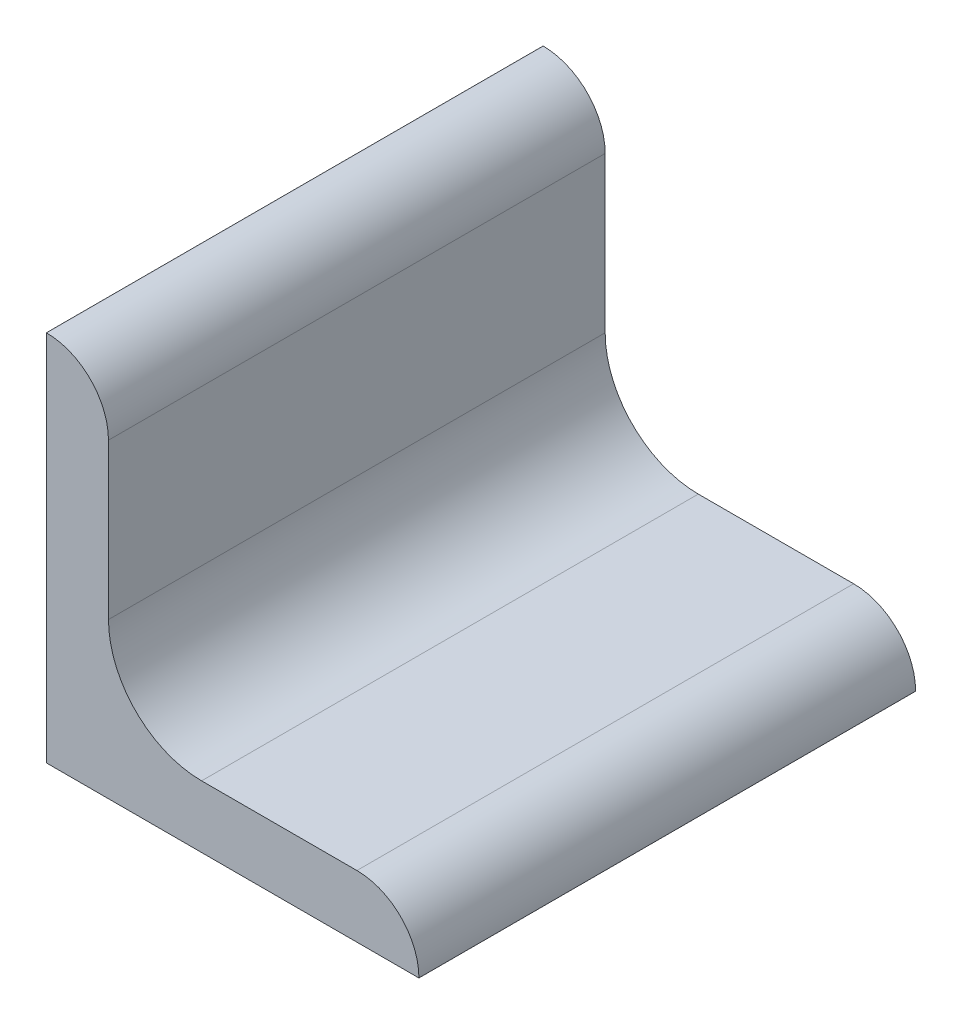
ISO-10303-21;
HEADER;
FILE_DESCRIPTION(('STEP AP214'),'2;1');
FILE_NAME('part.step','',(''),(''),'','','');
FILE_SCHEMA(('AUTOMOTIVE_DESIGN { 1 0 10303 214 1 1 1 1 }'));
ENDSEC;
DATA;
#1=APPLICATION_CONTEXT('core data for automotive mechanical design processes');
#2=APPLICATION_PROTOCOL_DEFINITION('international standard','automotive_design',2000,#1);
#3=PRODUCT_CONTEXT('',#1,'mechanical');
#4=PRODUCT('Part','Part','',(#3));
#5=PRODUCT_RELATED_PRODUCT_CATEGORY('part','',(#4));
#6=PRODUCT_DEFINITION_FORMATION('','',#4);
#7=PRODUCT_DEFINITION_CONTEXT('part definition',#1,'design');
#8=PRODUCT_DEFINITION('design','',#6,#7);
#9=PRODUCT_DEFINITION_SHAPE('','',#8);
#10=(LENGTH_UNIT() NAMED_UNIT(*) SI_UNIT(.MILLI.,.METRE.));
#11=(NAMED_UNIT(*) PLANE_ANGLE_UNIT() SI_UNIT($,.RADIAN.));
#12=(NAMED_UNIT(*) SI_UNIT($,.STERADIAN.) SOLID_ANGLE_UNIT());
#13=UNCERTAINTY_MEASURE_WITH_UNIT(LENGTH_MEASURE(1.E-05),#10,'distance_accuracy_value','');
#14=(GEOMETRIC_REPRESENTATION_CONTEXT(3) GLOBAL_UNCERTAINTY_ASSIGNED_CONTEXT((#13)) GLOBAL_UNIT_ASSIGNED_CONTEXT((#10,
#11,#12)) REPRESENTATION_CONTEXT('',''));
#15=CARTESIAN_POINT('',(0.,0.,0.));
#16=DIRECTION('',(0.,0.,1.));
#17=DIRECTION('',(1.,0.,0.));
#18=AXIS2_PLACEMENT_3D('',#15,#16,#17);
#19=CARTESIAN_POINT('',(19.05,0.,12.7));
#20=DIRECTION('',(0.,1.,0.));
#21=DIRECTION('',(-1.,0.,0.));
#22=AXIS2_PLACEMENT_3D('',#19,#20,#21);
#23=PLANE('',#22);
#24=DIRECTION('',(1.,0.,0.));
#25=VECTOR('',#24,1.);
#26=CARTESIAN_POINT('',(19.05,0.,-12.7));
#27=LINE('',#26,#25);
#28=CARTESIAN_POINT('',(0.,0.,-12.7));
#29=VERTEX_POINT('',#28);
#30=CARTESIAN_POINT('',(19.05,0.,-12.7));
#31=VERTEX_POINT('',#30);
#32=EDGE_CURVE('E135',#29,#31,#27,.T.);
#33=ORIENTED_EDGE('',*,*,#32,.T.);
#34=DIRECTION('',(0.,0.,-1.));
#35=VECTOR('',#34,1.);
#36=CARTESIAN_POINT('',(19.05,0.,12.7));
#37=LINE('',#36,#35);
#38=CARTESIAN_POINT('',(19.05,0.,12.7));
#39=VERTEX_POINT('',#38);
#40=EDGE_CURVE('E11',#39,#31,#37,.T.);
#41=ORIENTED_EDGE('',*,*,#40,.F.);
#42=DIRECTION('',(1.,0.,0.));
#43=VECTOR('',#42,1.);
#44=CARTESIAN_POINT('',(19.05,0.,12.7));
#45=LINE('',#44,#43);
#46=CARTESIAN_POINT('',(0.,0.,12.7));
#47=VERTEX_POINT('',#46);
#48=EDGE_CURVE('E151',#47,#39,#45,.T.);
#49=ORIENTED_EDGE('',*,*,#48,.F.);
#50=DIRECTION('',(0.,0.,-1.));
#51=VECTOR('',#50,1.);
#52=CARTESIAN_POINT('',(0.,0.,12.7));
#53=LINE('',#52,#51);
#54=EDGE_CURVE('E131',#47,#29,#53,.T.);
#55=ORIENTED_EDGE('',*,*,#54,.T.);
#56=EDGE_LOOP('',(#33,#41,#49,#55));
#57=FACE_BOUND('',#56,.T.);
#58=ADVANCED_FACE('F33',(#57),#23,.F.);
#59=CARTESIAN_POINT('',(19.05,0.00507999999999611,12.7));
#60=DIRECTION('',(-1.,0.,0.));
#61=DIRECTION('',(0.,0.,1.));
#62=AXIS2_PLACEMENT_3D('',#59,#60,#61);
#63=PLANE('',#62);
#64=DIRECTION('',(0.,1.,0.));
#65=VECTOR('',#64,1.);
#66=CARTESIAN_POINT('',(19.05,0.00507999999999611,-12.7));
#67=LINE('',#66,#65);
#68=CARTESIAN_POINT('',(19.05,0.00507999999999611,-12.7));
#69=VERTEX_POINT('',#68);
#70=EDGE_CURVE('E138',#31,#69,#67,.T.);
#71=ORIENTED_EDGE('',*,*,#70,.T.);
#72=DIRECTION('',(0.,0.,-1.));
#73=VECTOR('',#72,1.);
#74=CARTESIAN_POINT('',(19.05,0.00507999999999611,12.7));
#75=LINE('',#74,#73);
#76=CARTESIAN_POINT('',(19.05,0.00507999999999611,12.7));
#77=VERTEX_POINT('',#76);
#78=EDGE_CURVE('E41',#77,#69,#75,.T.);
#79=ORIENTED_EDGE('',*,*,#78,.F.);
#80=DIRECTION('',(0.,1.,0.));
#81=VECTOR('',#80,1.);
#82=CARTESIAN_POINT('',(19.05,0.00507999999999611,12.7));
#83=LINE('',#82,#81);
#84=EDGE_CURVE('E95',#39,#77,#83,.T.);
#85=ORIENTED_EDGE('',*,*,#84,.F.);
#86=ORIENTED_EDGE('',*,*,#40,.T.);
#87=EDGE_LOOP('',(#71,#79,#85,#86));
#88=FACE_BOUND('',#87,.T.);
#89=ADVANCED_FACE('F194',(#88),#63,.F.);
#90=CARTESIAN_POINT('',(15.88008,0.00507999999999573,12.7));
#91=DIRECTION('',(0.,0.,-1.));
#92=DIRECTION('',(-1.,0.,0.));
#93=AXIS2_PLACEMENT_3D('',#90,#91,#92);
#94=CYLINDRICAL_SURFACE('',#93,3.16992);
#95=CARTESIAN_POINT('',(15.88008,0.00507999999999573,-12.7));
#96=DIRECTION('',(0.,0.,1.));
#97=DIRECTION('',(1.,0.,0.));
#98=AXIS2_PLACEMENT_3D('',#95,#96,#97);
#99=CIRCLE('',#98,3.16992);
#100=CARTESIAN_POINT('',(15.88008,3.17499999999999,-12.7));
#101=VERTEX_POINT('',#100);
#102=EDGE_CURVE('E140',#69,#101,#99,.T.);
#103=ORIENTED_EDGE('',*,*,#102,.T.);
#104=DIRECTION('',(0.,0.,-1.));
#105=VECTOR('',#104,1.);
#106=CARTESIAN_POINT('',(15.88008,3.17499999999999,12.7));
#107=LINE('',#106,#105);
#108=CARTESIAN_POINT('',(15.88008,3.17499999999999,12.7));
#109=VERTEX_POINT('',#108);
#110=EDGE_CURVE('E161',#109,#101,#107,.T.);
#111=ORIENTED_EDGE('',*,*,#110,.F.);
#112=CARTESIAN_POINT('',(15.88008,0.00507999999999573,12.7));
#113=DIRECTION('',(0.,0.,1.));
#114=DIRECTION('',(1.,0.,0.));
#115=AXIS2_PLACEMENT_3D('',#112,#113,#114);
#116=CIRCLE('',#115,3.16992);
#117=EDGE_CURVE('E169',#77,#109,#116,.T.);
#118=ORIENTED_EDGE('',*,*,#117,.F.);
#119=ORIENTED_EDGE('',*,*,#78,.T.);
#120=EDGE_LOOP('',(#103,#111,#118,#119));
#121=FACE_BOUND('',#120,.T.);
#122=ADVANCED_FACE('F167',(#121),#94,.T.);
#123=CARTESIAN_POINT('',(7.93749999999999,3.175,12.7));
#124=DIRECTION('',(0.,-1.,0.));
#125=DIRECTION('',(1.,0.,0.));
#126=AXIS2_PLACEMENT_3D('',#123,#124,#125);
#127=PLANE('',#126);
#128=DIRECTION('',(-1.,0.,0.));
#129=VECTOR('',#128,1.);
#130=CARTESIAN_POINT('',(7.93749999999999,3.175,-12.7));
#131=LINE('',#130,#129);
#132=CARTESIAN_POINT('',(7.93749999999999,3.17499999999999,-12.7));
#133=VERTEX_POINT('',#132);
#134=EDGE_CURVE('E142',#101,#133,#131,.T.);
#135=ORIENTED_EDGE('',*,*,#134,.T.);
#136=DIRECTION('',(0.,0.,-1.));
#137=VECTOR('',#136,1.);
#138=CARTESIAN_POINT('',(7.93749999999999,3.17499999999999,12.7));
#139=LINE('',#138,#137);
#140=CARTESIAN_POINT('',(7.93749999999999,3.17499999999999,12.7));
#141=VERTEX_POINT('',#140);
#142=EDGE_CURVE('E158',#141,#133,#139,.T.);
#143=ORIENTED_EDGE('',*,*,#142,.F.);
#144=DIRECTION('',(-1.,0.,0.));
#145=VECTOR('',#144,1.);
#146=CARTESIAN_POINT('',(7.93749999999999,3.175,12.7));
#147=LINE('',#146,#145);
#148=EDGE_CURVE('E185',#109,#141,#147,.T.);
#149=ORIENTED_EDGE('',*,*,#148,.F.);
#150=ORIENTED_EDGE('',*,*,#110,.T.);
#151=EDGE_LOOP('',(#135,#143,#149,#150));
#152=FACE_BOUND('',#151,.T.);
#153=ADVANCED_FACE('F178',(#152),#127,.F.);
#154=CARTESIAN_POINT('',(7.93749999999999,7.93749999999999,12.7));
#155=DIRECTION('',(0.,0.,-1.));
#156=DIRECTION('',(-1.,0.,0.));
#157=AXIS2_PLACEMENT_3D('',#154,#155,#156);
#158=CYLINDRICAL_SURFACE('',#157,4.7625);
#159=CARTESIAN_POINT('',(7.93749999999999,7.93749999999999,-12.7));
#160=DIRECTION('',(0.,0.,-1.));
#161=DIRECTION('',(-1.,0.,0.));
#162=AXIS2_PLACEMENT_3D('',#159,#160,#161);
#163=CIRCLE('',#162,4.7625);
#164=CARTESIAN_POINT('',(3.17499999999999,7.93749999999999,-12.7));
#165=VERTEX_POINT('',#164);
#166=EDGE_CURVE('E144',#133,#165,#163,.T.);
#167=ORIENTED_EDGE('',*,*,#166,.T.);
#168=DIRECTION('',(0.,0.,-1.));
#169=VECTOR('',#168,1.);
#170=CARTESIAN_POINT('',(3.17499999999999,7.93749999999999,12.7));
#171=LINE('',#170,#169);
#172=CARTESIAN_POINT('',(3.17499999999999,7.93749999999999,12.7));
#173=VERTEX_POINT('',#172);
#174=EDGE_CURVE('E155',#173,#165,#171,.T.);
#175=ORIENTED_EDGE('',*,*,#174,.F.);
#176=CARTESIAN_POINT('',(7.93749999999999,7.93749999999999,12.7));
#177=DIRECTION('',(0.,0.,-1.));
#178=DIRECTION('',(-1.,0.,0.));
#179=AXIS2_PLACEMENT_3D('',#176,#177,#178);
#180=CIRCLE('',#179,4.7625);
#181=EDGE_CURVE('E184',#141,#173,#180,.T.);
#182=ORIENTED_EDGE('',*,*,#181,.F.);
#183=ORIENTED_EDGE('',*,*,#142,.T.);
#184=EDGE_LOOP('',(#167,#175,#182,#183));
#185=FACE_BOUND('',#184,.T.);
#186=ADVANCED_FACE('F182',(#185),#158,.F.);
#187=CARTESIAN_POINT('',(3.175,15.88008,12.7));
#188=DIRECTION('',(-1.,0.,0.));
#189=DIRECTION('',(0.,-1.,0.));
#190=AXIS2_PLACEMENT_3D('',#187,#188,#189);
#191=PLANE('',#190);
#192=DIRECTION('',(0.,1.,0.));
#193=VECTOR('',#192,1.);
#194=CARTESIAN_POINT('',(3.175,15.88008,-12.7));
#195=LINE('',#194,#193);
#196=CARTESIAN_POINT('',(3.175,15.88008,-12.7));
#197=VERTEX_POINT('',#196);
#198=EDGE_CURVE('E146',#165,#197,#195,.T.);
#199=ORIENTED_EDGE('',*,*,#198,.T.);
#200=DIRECTION('',(0.,0.,-1.));
#201=VECTOR('',#200,1.);
#202=CARTESIAN_POINT('',(3.175,15.88008,12.7));
#203=LINE('',#202,#201);
#204=CARTESIAN_POINT('',(3.175,15.88008,12.7));
#205=VERTEX_POINT('',#204);
#206=EDGE_CURVE('E126',#205,#197,#203,.T.);
#207=ORIENTED_EDGE('',*,*,#206,.F.);
#208=DIRECTION('',(0.,1.,0.));
#209=VECTOR('',#208,1.);
#210=CARTESIAN_POINT('',(3.175,15.88008,12.7));
#211=LINE('',#210,#209);
#212=EDGE_CURVE('E117',#173,#205,#211,.T.);
#213=ORIENTED_EDGE('',*,*,#212,.F.);
#214=ORIENTED_EDGE('',*,*,#174,.T.);
#215=EDGE_LOOP('',(#199,#207,#213,#214));
#216=FACE_BOUND('',#215,.T.);
#217=ADVANCED_FACE('F206',(#216),#191,.F.);
#218=CARTESIAN_POINT('',(0.00508000000000019,15.88008,12.7));
#219=DIRECTION('',(0.,0.,-1.));
#220=DIRECTION('',(-1.,0.,0.));
#221=AXIS2_PLACEMENT_3D('',#218,#219,#220);
#222=CYLINDRICAL_SURFACE('',#221,3.16992);
#223=CARTESIAN_POINT('',(0.00508000000000019,15.88008,-12.7));
#224=DIRECTION('',(0.,0.,1.));
#225=DIRECTION('',(-1.,0.,0.));
#226=AXIS2_PLACEMENT_3D('',#223,#224,#225);
#227=CIRCLE('',#226,3.16992);
#228=CARTESIAN_POINT('',(0.00508,19.05,-12.7));
#229=VERTEX_POINT('',#228);
#230=EDGE_CURVE('E125',#197,#229,#227,.T.);
#231=ORIENTED_EDGE('',*,*,#230,.T.);
#232=DIRECTION('',(0.,0.,-1.));
#233=VECTOR('',#232,1.);
#234=CARTESIAN_POINT('',(0.00508,19.05,12.7));
#235=LINE('',#234,#233);
#236=CARTESIAN_POINT('',(0.00508,19.05,12.7));
#237=VERTEX_POINT('',#236);
#238=EDGE_CURVE('E122',#237,#229,#235,.T.);
#239=ORIENTED_EDGE('',*,*,#238,.F.);
#240=CARTESIAN_POINT('',(0.00508000000000019,15.88008,12.7));
#241=DIRECTION('',(0.,0.,1.));
#242=DIRECTION('',(-1.,0.,0.));
#243=AXIS2_PLACEMENT_3D('',#240,#241,#242);
#244=CIRCLE('',#243,3.16992);
#245=EDGE_CURVE('E111',#205,#237,#244,.T.);
#246=ORIENTED_EDGE('',*,*,#245,.F.);
#247=ORIENTED_EDGE('',*,*,#206,.T.);
#248=EDGE_LOOP('',(#231,#239,#246,#247));
#249=FACE_BOUND('',#248,.T.);
#250=ADVANCED_FACE('F123',(#249),#222,.T.);
#251=CARTESIAN_POINT('',(0.,19.05,12.7));
#252=DIRECTION('',(0.,-1.,0.));
#253=DIRECTION('',(0.,0.,-1.));
#254=AXIS2_PLACEMENT_3D('',#251,#252,#253);
#255=PLANE('',#254);
#256=DIRECTION('',(-1.,0.,0.));
#257=VECTOR('',#256,1.);
#258=CARTESIAN_POINT('',(0.,19.05,-12.7));
#259=LINE('',#258,#257);
#260=CARTESIAN_POINT('',(0.,19.05,-12.7));
#261=VERTEX_POINT('',#260);
#262=EDGE_CURVE('E81',#229,#261,#259,.T.);
#263=ORIENTED_EDGE('',*,*,#262,.T.);
#264=DIRECTION('',(0.,0.,-1.));
#265=VECTOR('',#264,1.);
#266=CARTESIAN_POINT('',(0.,19.05,12.7));
#267=LINE('',#266,#265);
#268=CARTESIAN_POINT('',(0.,19.05,12.7));
#269=VERTEX_POINT('',#268);
#270=EDGE_CURVE('E127',#269,#261,#267,.T.);
#271=ORIENTED_EDGE('',*,*,#270,.F.);
#272=DIRECTION('',(-1.,0.,0.));
#273=VECTOR('',#272,1.);
#274=CARTESIAN_POINT('',(0.,19.05,12.7));
#275=LINE('',#274,#273);
#276=EDGE_CURVE('E115',#237,#269,#275,.T.);
#277=ORIENTED_EDGE('',*,*,#276,.F.);
#278=ORIENTED_EDGE('',*,*,#238,.T.);
#279=EDGE_LOOP('',(#263,#271,#277,#278));
#280=FACE_BOUND('',#279,.T.);
#281=ADVANCED_FACE('F129',(#280),#255,.F.);
#282=CARTESIAN_POINT('',(0.,0.,12.7));
#283=DIRECTION('',(1.,0.,0.));
#284=DIRECTION('',(0.,0.,-1.));
#285=AXIS2_PLACEMENT_3D('',#282,#283,#284);
#286=PLANE('',#285);
#287=DIRECTION('',(0.,-1.,0.));
#288=VECTOR('',#287,1.);
#289=CARTESIAN_POINT('',(0.,0.,-12.7));
#290=LINE('',#289,#288);
#291=EDGE_CURVE('E87',#261,#29,#290,.T.);
#292=ORIENTED_EDGE('',*,*,#291,.T.);
#293=ORIENTED_EDGE('',*,*,#54,.F.);
#294=DIRECTION('',(0.,-1.,0.));
#295=VECTOR('',#294,1.);
#296=CARTESIAN_POINT('',(0.,0.,12.7));
#297=LINE('',#296,#295);
#298=EDGE_CURVE('E49',#269,#47,#297,.T.);
#299=ORIENTED_EDGE('',*,*,#298,.F.);
#300=ORIENTED_EDGE('',*,*,#270,.T.);
#301=EDGE_LOOP('',(#292,#293,#299,#300));
#302=FACE_BOUND('',#301,.T.);
#303=ADVANCED_FACE('F214',(#302),#286,.F.);
#304=CARTESIAN_POINT('',(0.00508000000000019,15.88008,12.7));
#305=DIRECTION('',(0.,0.,-1.));
#306=DIRECTION('',(-1.,0.,0.));
#307=AXIS2_PLACEMENT_3D('',#304,#305,#306);
#308=PLANE('',#307);
#309=ORIENTED_EDGE('',*,*,#48,.T.);
#310=ORIENTED_EDGE('',*,*,#84,.T.);
#311=ORIENTED_EDGE('',*,*,#117,.T.);
#312=ORIENTED_EDGE('',*,*,#148,.T.);
#313=ORIENTED_EDGE('',*,*,#181,.T.);
#314=ORIENTED_EDGE('',*,*,#212,.T.);
#315=ORIENTED_EDGE('',*,*,#245,.T.);
#316=ORIENTED_EDGE('',*,*,#276,.T.);
#317=ORIENTED_EDGE('',*,*,#298,.T.);
#318=EDGE_LOOP('',(#309,#310,#311,#312,#313,#314,#315,#316,#317));
#319=FACE_BOUND('',#318,.T.);
#320=ADVANCED_FACE('F113',(#319),#308,.F.);
#321=CARTESIAN_POINT('',(0.00508000000000019,15.88008,-12.7));
#322=DIRECTION('',(0.,0.,-1.));
#323=DIRECTION('',(-1.,0.,0.));
#324=AXIS2_PLACEMENT_3D('',#321,#322,#323);
#325=PLANE('',#324);
#326=ORIENTED_EDGE('',*,*,#32,.F.);
#327=ORIENTED_EDGE('',*,*,#291,.F.);
#328=ORIENTED_EDGE('',*,*,#262,.F.);
#329=ORIENTED_EDGE('',*,*,#230,.F.);
#330=ORIENTED_EDGE('',*,*,#198,.F.);
#331=ORIENTED_EDGE('',*,*,#166,.F.);
#332=ORIENTED_EDGE('',*,*,#134,.F.);
#333=ORIENTED_EDGE('',*,*,#102,.F.);
#334=ORIENTED_EDGE('',*,*,#70,.F.);
#335=EDGE_LOOP('',(#326,#327,#328,#329,#330,#331,#332,#333,#334));
#336=FACE_BOUND('',#335,.T.);
#337=ADVANCED_FACE('F173',(#336),#325,.T.);
#338=CLOSED_SHELL('',(#58,#89,#122,#153,#186,#217,#250,#281,#303,#320,#337));
#339=MANIFOLD_SOLID_BREP('B2',#338);
#340=ADVANCED_BREP_SHAPE_REPRESENTATION('',(#18,#339),#14);
#341=SHAPE_DEFINITION_REPRESENTATION(#9,#340);
ENDSEC;
END-ISO-10303-21;
